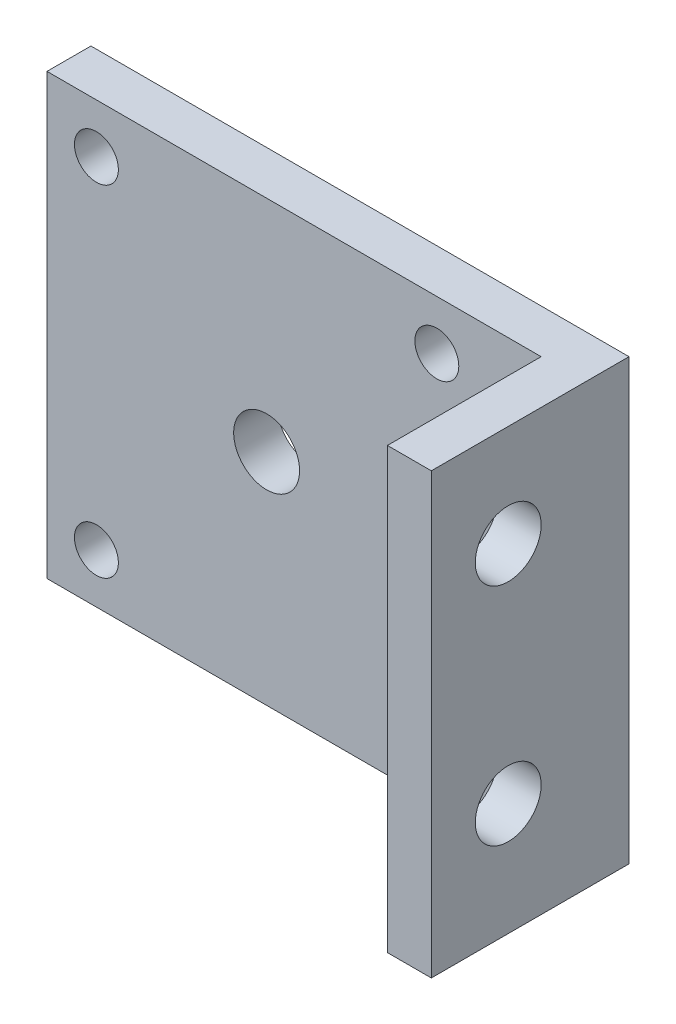
ISO-10303-21;
HEADER;
FILE_DESCRIPTION(('STEP AP214'),'2;1');
FILE_NAME('part.step','',(''),(''),'','','');
FILE_SCHEMA(('AUTOMOTIVE_DESIGN { 1 0 10303 214 1 1 1 1 }'));
ENDSEC;
DATA;
#1=APPLICATION_CONTEXT('core data for automotive mechanical design processes');
#2=APPLICATION_PROTOCOL_DEFINITION('international standard','automotive_design',2000,#1);
#3=PRODUCT_CONTEXT('',#1,'mechanical');
#4=PRODUCT('Part','Part','',(#3));
#5=PRODUCT_RELATED_PRODUCT_CATEGORY('part','',(#4));
#6=PRODUCT_DEFINITION_FORMATION('','',#4);
#7=PRODUCT_DEFINITION_CONTEXT('part definition',#1,'design');
#8=PRODUCT_DEFINITION('design','',#6,#7);
#9=PRODUCT_DEFINITION_SHAPE('','',#8);
#10=(LENGTH_UNIT() NAMED_UNIT(*) SI_UNIT(.MILLI.,.METRE.));
#11=(NAMED_UNIT(*) PLANE_ANGLE_UNIT() SI_UNIT($,.RADIAN.));
#12=(NAMED_UNIT(*) SI_UNIT($,.STERADIAN.) SOLID_ANGLE_UNIT());
#13=UNCERTAINTY_MEASURE_WITH_UNIT(LENGTH_MEASURE(1.E-05),#10,'distance_accuracy_value','');
#14=(GEOMETRIC_REPRESENTATION_CONTEXT(3) GLOBAL_UNCERTAINTY_ASSIGNED_CONTEXT((#13)) GLOBAL_UNIT_ASSIGNED_CONTEXT((#10,
#11,#12)) REPRESENTATION_CONTEXT('',''));
#15=CARTESIAN_POINT('',(0.,0.,0.));
#16=DIRECTION('',(0.,0.,1.));
#17=DIRECTION('',(1.,0.,0.));
#18=AXIS2_PLACEMENT_3D('',#15,#16,#17);
#19=CARTESIAN_POINT('',(-27.0858644859813,17.290404040404,4.));
#20=DIRECTION('',(1.,0.,0.));
#21=DIRECTION('',(0.,1.,0.));
#22=AXIS2_PLACEMENT_3D('',#19,#20,#21);
#23=PLANE('',#22);
#24=DIRECTION('',(0.,-1.,0.));
#25=VECTOR('',#24,1.);
#26=CARTESIAN_POINT('',(-27.0858644859813,17.290404040404,0.));
#27=LINE('',#26,#25);
#28=CARTESIAN_POINT('',(-27.0858644859813,17.290404040404,0.));
#29=VERTEX_POINT('',#28);
#30=CARTESIAN_POINT('',(-27.0858644859813,-22.709595959596,0.));
#31=VERTEX_POINT('',#30);
#32=EDGE_CURVE('E91',#29,#31,#27,.T.);
#33=ORIENTED_EDGE('',*,*,#32,.T.);
#34=DIRECTION('',(0.,0.,-1.));
#35=VECTOR('',#34,1.);
#36=CARTESIAN_POINT('',(-27.0858644859813,-22.709595959596,4.));
#37=LINE('',#36,#35);
#38=CARTESIAN_POINT('',(-27.0858644859813,-22.709595959596,4.));
#39=VERTEX_POINT('',#38);
#40=EDGE_CURVE('E11',#39,#31,#37,.T.);
#41=ORIENTED_EDGE('',*,*,#40,.F.);
#42=DIRECTION('',(0.,-1.,0.));
#43=VECTOR('',#42,1.);
#44=CARTESIAN_POINT('',(-27.0858644859813,17.290404040404,4.));
#45=LINE('',#44,#43);
#46=CARTESIAN_POINT('',(-27.0858644859813,17.290404040404,4.));
#47=VERTEX_POINT('',#46);
#48=EDGE_CURVE('E85',#47,#39,#45,.T.);
#49=ORIENTED_EDGE('',*,*,#48,.F.);
#50=DIRECTION('',(0.,0.,-1.));
#51=VECTOR('',#50,1.);
#52=CARTESIAN_POINT('',(-27.0858644859813,17.290404040404,4.));
#53=LINE('',#52,#51);
#54=EDGE_CURVE('E77',#47,#29,#53,.T.);
#55=ORIENTED_EDGE('',*,*,#54,.T.);
#56=EDGE_LOOP('',(#33,#41,#49,#55));
#57=FACE_BOUND('',#56,.T.);
#58=ADVANCED_FACE('F33',(#57),#23,.F.);
#59=CARTESIAN_POINT('',(-27.0858644859813,-22.709595959596,4.));
#60=DIRECTION('',(0.,1.,0.));
#61=DIRECTION('',(0.,0.,1.));
#62=AXIS2_PLACEMENT_3D('',#59,#60,#61);
#63=PLANE('',#62);
#64=DIRECTION('',(1.,0.,0.));
#65=VECTOR('',#64,1.);
#66=CARTESIAN_POINT('',(-27.0858644859813,-22.709595959596,0.));
#67=LINE('',#66,#65);
#68=CARTESIAN_POINT('',(21.9141355140187,-22.709595959596,0.));
#69=VERTEX_POINT('',#68);
#70=EDGE_CURVE('E94',#31,#69,#67,.T.);
#71=ORIENTED_EDGE('',*,*,#70,.T.);
#72=DIRECTION('',(0.,0.,-1.));
#73=VECTOR('',#72,1.);
#74=CARTESIAN_POINT('',(21.9141355140187,-22.709595959596,4.));
#75=LINE('',#74,#73);
#76=CARTESIAN_POINT('',(21.9141355140187,-22.709595959596,18.));
#77=VERTEX_POINT('',#76);
#78=EDGE_CURVE('E41',#77,#69,#75,.T.);
#79=ORIENTED_EDGE('',*,*,#78,.F.);
#80=DIRECTION('',(1.,0.,0.));
#81=VECTOR('',#80,1.);
#82=CARTESIAN_POINT('',(21.9141355140187,-22.709595959596,18.));
#83=LINE('',#82,#81);
#84=CARTESIAN_POINT('',(17.9141355140187,-22.709595959596,18.));
#85=VERTEX_POINT('',#84);
#86=EDGE_CURVE('E116',#85,#77,#83,.T.);
#87=ORIENTED_EDGE('',*,*,#86,.F.);
#88=DIRECTION('',(0.,0.,-1.));
#89=VECTOR('',#88,1.);
#90=CARTESIAN_POINT('',(17.9141355140187,-22.709595959596,18.));
#91=LINE('',#90,#89);
#92=CARTESIAN_POINT('',(17.9141355140187,-22.709595959596,4.));
#93=VERTEX_POINT('',#92);
#94=EDGE_CURVE('E99',#85,#93,#91,.T.);
#95=ORIENTED_EDGE('',*,*,#94,.T.);
#96=DIRECTION('',(1.,0.,0.));
#97=VECTOR('',#96,1.);
#98=CARTESIAN_POINT('',(-27.0858644859813,-22.709595959596,4.));
#99=LINE('',#98,#97);
#100=EDGE_CURVE('E108',#39,#93,#99,.T.);
#101=ORIENTED_EDGE('',*,*,#100,.F.);
#102=ORIENTED_EDGE('',*,*,#40,.T.);
#103=EDGE_LOOP('',(#71,#79,#87,#95,#101,#102));
#104=FACE_BOUND('',#103,.T.);
#105=ADVANCED_FACE('F222',(#104),#63,.F.);
#106=CARTESIAN_POINT('',(21.9141355140187,17.290404040404,4.));
#107=DIRECTION('',(-1.,0.,0.));
#108=DIRECTION('',(0.,-1.,0.));
#109=AXIS2_PLACEMENT_3D('',#106,#107,#108);
#110=PLANE('',#109);
#111=CARTESIAN_POINT('',(21.9141355140187,-12.4595959595959,11.));
#112=DIRECTION('',(1.,0.,0.));
#113=DIRECTION('',(0.,1.,0.));
#114=AXIS2_PLACEMENT_3D('',#111,#112,#113);
#115=CIRCLE('',#114,3.);
#116=CARTESIAN_POINT('',(21.9141355140187,-9.45959595959595,11.));
#117=VERTEX_POINT('',#116);
#118=EDGE_CURVE('E147',#117,#117,#115,.T.);
#119=ORIENTED_EDGE('',*,*,#118,.F.);
#120=EDGE_LOOP('',(#119));
#121=FACE_BOUND('',#120,.T.);
#122=CARTESIAN_POINT('',(21.9141355140187,8.04040404040405,11.));
#123=DIRECTION('',(1.,0.,0.));
#124=DIRECTION('',(0.,1.,0.));
#125=AXIS2_PLACEMENT_3D('',#122,#123,#124);
#126=CIRCLE('',#125,3.);
#127=CARTESIAN_POINT('',(21.9141355140187,11.0404040404041,11.));
#128=VERTEX_POINT('',#127);
#129=EDGE_CURVE('E141',#128,#128,#126,.T.);
#130=ORIENTED_EDGE('',*,*,#129,.F.);
#131=EDGE_LOOP('',(#130));
#132=FACE_BOUND('',#131,.T.);
#133=DIRECTION('',(0.,1.,0.));
#134=VECTOR('',#133,1.);
#135=CARTESIAN_POINT('',(21.9141355140187,17.290404040404,0.));
#136=LINE('',#135,#134);
#137=CARTESIAN_POINT('',(21.9141355140187,17.290404040404,0.));
#138=VERTEX_POINT('',#137);
#139=EDGE_CURVE('E86',#69,#138,#136,.T.);
#140=ORIENTED_EDGE('',*,*,#139,.T.);
#141=DIRECTION('',(0.,0.,-1.));
#142=VECTOR('',#141,1.);
#143=CARTESIAN_POINT('',(21.9141355140187,17.290404040404,4.));
#144=LINE('',#143,#142);
#145=CARTESIAN_POINT('',(21.9141355140187,17.290404040404,18.));
#146=VERTEX_POINT('',#145);
#147=EDGE_CURVE('E81',#146,#138,#144,.T.);
#148=ORIENTED_EDGE('',*,*,#147,.F.);
#149=DIRECTION('',(0.,1.,0.));
#150=VECTOR('',#149,1.);
#151=CARTESIAN_POINT('',(21.9141355140187,17.290404040404,18.));
#152=LINE('',#151,#150);
#153=EDGE_CURVE('E119',#77,#146,#152,.T.);
#154=ORIENTED_EDGE('',*,*,#153,.F.);
#155=ORIENTED_EDGE('',*,*,#78,.T.);
#156=EDGE_LOOP('',(#140,#148,#154,#155));
#157=FACE_BOUND('',#156,.T.);
#158=ADVANCED_FACE('F226',(#121,#132,#157),#110,.F.);
#159=CARTESIAN_POINT('',(-27.0858644859813,17.290404040404,4.));
#160=DIRECTION('',(0.,-1.,0.));
#161=DIRECTION('',(0.,0.,-1.));
#162=AXIS2_PLACEMENT_3D('',#159,#160,#161);
#163=PLANE('',#162);
#164=DIRECTION('',(-1.,0.,0.));
#165=VECTOR('',#164,1.);
#166=CARTESIAN_POINT('',(-27.0858644859813,17.290404040404,0.));
#167=LINE('',#166,#165);
#168=EDGE_CURVE('E74',#138,#29,#167,.T.);
#169=ORIENTED_EDGE('',*,*,#168,.T.);
#170=ORIENTED_EDGE('',*,*,#54,.F.);
#171=DIRECTION('',(-1.,0.,0.));
#172=VECTOR('',#171,1.);
#173=CARTESIAN_POINT('',(-27.0858644859813,17.290404040404,4.));
#174=LINE('',#173,#172);
#175=CARTESIAN_POINT('',(17.9141355140187,17.290404040404,4.));
#176=VERTEX_POINT('',#175);
#177=EDGE_CURVE('E54',#176,#47,#174,.T.);
#178=ORIENTED_EDGE('',*,*,#177,.F.);
#179=DIRECTION('',(0.,0.,-1.));
#180=VECTOR('',#179,1.);
#181=CARTESIAN_POINT('',(17.9141355140187,17.290404040404,18.));
#182=LINE('',#181,#180);
#183=CARTESIAN_POINT('',(17.9141355140187,17.290404040404,18.));
#184=VERTEX_POINT('',#183);
#185=EDGE_CURVE('E95',#184,#176,#182,.T.);
#186=ORIENTED_EDGE('',*,*,#185,.F.);
#187=DIRECTION('',(-1.,0.,0.));
#188=VECTOR('',#187,1.);
#189=CARTESIAN_POINT('',(21.9141355140187,17.290404040404,18.));
#190=LINE('',#189,#188);
#191=EDGE_CURVE('E134',#146,#184,#190,.T.);
#192=ORIENTED_EDGE('',*,*,#191,.F.);
#193=ORIENTED_EDGE('',*,*,#147,.T.);
#194=EDGE_LOOP('',(#169,#170,#178,#186,#192,#193));
#195=FACE_BOUND('',#194,.T.);
#196=ADVANCED_FACE('F76',(#195),#163,.F.);
#197=CARTESIAN_POINT('',(0.,0.,4.));
#198=DIRECTION('',(0.,0.,1.));
#199=DIRECTION('',(1.,0.,0.));
#200=AXIS2_PLACEMENT_3D('',#197,#198,#199);
#201=PLANE('',#200);
#202=CARTESIAN_POINT('',(-22.5858644859813,-18.209595959596,4.));
#203=DIRECTION('',(0.,0.,1.));
#204=DIRECTION('',(1.,0.,0.));
#205=AXIS2_PLACEMENT_3D('',#202,#203,#204);
#206=CIRCLE('',#205,2.);
#207=CARTESIAN_POINT('',(-20.5858644859813,-18.209595959596,4.));
#208=VERTEX_POINT('',#207);
#209=EDGE_CURVE('E177',#208,#208,#206,.T.);
#210=ORIENTED_EDGE('',*,*,#209,.F.);
#211=EDGE_LOOP('',(#210));
#212=FACE_BOUND('',#211,.T.);
#213=CARTESIAN_POINT('',(8.4141355140187,-18.2095959595959,4.));
#214=DIRECTION('',(0.,0.,1.));
#215=DIRECTION('',(1.,0.,0.));
#216=AXIS2_PLACEMENT_3D('',#213,#214,#215);
#217=CIRCLE('',#216,2.);
#218=CARTESIAN_POINT('',(10.4141355140187,-18.2095959595959,4.));
#219=VERTEX_POINT('',#218);
#220=EDGE_CURVE('E171',#219,#219,#217,.T.);
#221=ORIENTED_EDGE('',*,*,#220,.F.);
#222=EDGE_LOOP('',(#221));
#223=FACE_BOUND('',#222,.T.);
#224=CARTESIAN_POINT('',(8.4141355140187,12.7904040404041,4.));
#225=DIRECTION('',(0.,0.,1.));
#226=DIRECTION('',(1.,0.,0.));
#227=AXIS2_PLACEMENT_3D('',#224,#225,#226);
#228=CIRCLE('',#227,2.);
#229=CARTESIAN_POINT('',(10.4141355140187,12.7904040404041,4.));
#230=VERTEX_POINT('',#229);
#231=EDGE_CURVE('E165',#230,#230,#228,.T.);
#232=ORIENTED_EDGE('',*,*,#231,.F.);
#233=EDGE_LOOP('',(#232));
#234=FACE_BOUND('',#233,.T.);
#235=CARTESIAN_POINT('',(-22.5858644859813,12.7904040404041,4.));
#236=DIRECTION('',(0.,0.,1.));
#237=DIRECTION('',(1.,0.,0.));
#238=AXIS2_PLACEMENT_3D('',#235,#236,#237);
#239=CIRCLE('',#238,2.);
#240=CARTESIAN_POINT('',(-20.5858644859813,12.7904040404041,4.));
#241=VERTEX_POINT('',#240);
#242=EDGE_CURVE('E159',#241,#241,#239,.T.);
#243=ORIENTED_EDGE('',*,*,#242,.F.);
#244=EDGE_LOOP('',(#243));
#245=FACE_BOUND('',#244,.T.);
#246=CARTESIAN_POINT('',(-7.0858644859813,-2.70959595959595,4.));
#247=DIRECTION('',(0.,0.,1.));
#248=DIRECTION('',(1.,0.,0.));
#249=AXIS2_PLACEMENT_3D('',#246,#247,#248);
#250=CIRCLE('',#249,3.);
#251=CARTESIAN_POINT('',(-4.0858644859813,-2.70959595959595,4.));
#252=VERTEX_POINT('',#251);
#253=EDGE_CURVE('E153',#252,#252,#250,.T.);
#254=ORIENTED_EDGE('',*,*,#253,.F.);
#255=EDGE_LOOP('',(#254));
#256=FACE_BOUND('',#255,.T.);
#257=DIRECTION('',(0.,-1.,0.));
#258=VECTOR('',#257,1.);
#259=CARTESIAN_POINT('',(17.9141355140187,17.290404040404,4.));
#260=LINE('',#259,#258);
#261=EDGE_CURVE('E49',#176,#93,#260,.T.);
#262=ORIENTED_EDGE('',*,*,#261,.F.);
#263=ORIENTED_EDGE('',*,*,#177,.T.);
#264=ORIENTED_EDGE('',*,*,#48,.T.);
#265=ORIENTED_EDGE('',*,*,#100,.T.);
#266=EDGE_LOOP('',(#262,#263,#264,#265));
#267=FACE_BOUND('',#266,.T.);
#268=ADVANCED_FACE('F192',(#212,#223,#234,#245,#256,#267),#201,.T.);
#269=CARTESIAN_POINT('',(0.,0.,0.));
#270=DIRECTION('',(0.,0.,1.));
#271=DIRECTION('',(1.,0.,0.));
#272=AXIS2_PLACEMENT_3D('',#269,#270,#271);
#273=PLANE('',#272);
#274=CARTESIAN_POINT('',(-22.5858644859813,-18.209595959596,0.));
#275=DIRECTION('',(0.,0.,1.));
#276=DIRECTION('',(1.,0.,0.));
#277=AXIS2_PLACEMENT_3D('',#274,#275,#276);
#278=CIRCLE('',#277,2.);
#279=CARTESIAN_POINT('',(-20.5858644859813,-18.209595959596,0.));
#280=VERTEX_POINT('',#279);
#281=EDGE_CURVE('E174',#280,#280,#278,.T.);
#282=ORIENTED_EDGE('',*,*,#281,.T.);
#283=EDGE_LOOP('',(#282));
#284=FACE_BOUND('',#283,.T.);
#285=CARTESIAN_POINT('',(8.4141355140187,-18.2095959595959,0.));
#286=DIRECTION('',(0.,0.,1.));
#287=DIRECTION('',(1.,0.,0.));
#288=AXIS2_PLACEMENT_3D('',#285,#286,#287);
#289=CIRCLE('',#288,2.);
#290=CARTESIAN_POINT('',(10.4141355140187,-18.2095959595959,0.));
#291=VERTEX_POINT('',#290);
#292=EDGE_CURVE('E168',#291,#291,#289,.T.);
#293=ORIENTED_EDGE('',*,*,#292,.T.);
#294=EDGE_LOOP('',(#293));
#295=FACE_BOUND('',#294,.T.);
#296=CARTESIAN_POINT('',(8.4141355140187,12.7904040404041,0.));
#297=DIRECTION('',(0.,0.,1.));
#298=DIRECTION('',(1.,0.,0.));
#299=AXIS2_PLACEMENT_3D('',#296,#297,#298);
#300=CIRCLE('',#299,2.);
#301=CARTESIAN_POINT('',(10.4141355140187,12.7904040404041,0.));
#302=VERTEX_POINT('',#301);
#303=EDGE_CURVE('E162',#302,#302,#300,.T.);
#304=ORIENTED_EDGE('',*,*,#303,.T.);
#305=EDGE_LOOP('',(#304));
#306=FACE_BOUND('',#305,.T.);
#307=CARTESIAN_POINT('',(-22.5858644859813,12.7904040404041,0.));
#308=DIRECTION('',(0.,0.,1.));
#309=DIRECTION('',(1.,0.,0.));
#310=AXIS2_PLACEMENT_3D('',#307,#308,#309);
#311=CIRCLE('',#310,2.);
#312=CARTESIAN_POINT('',(-20.5858644859813,12.7904040404041,0.));
#313=VERTEX_POINT('',#312);
#314=EDGE_CURVE('E156',#313,#313,#311,.T.);
#315=ORIENTED_EDGE('',*,*,#314,.T.);
#316=EDGE_LOOP('',(#315));
#317=FACE_BOUND('',#316,.T.);
#318=CARTESIAN_POINT('',(-7.0858644859813,-2.70959595959595,0.));
#319=DIRECTION('',(0.,0.,1.));
#320=DIRECTION('',(1.,0.,0.));
#321=AXIS2_PLACEMENT_3D('',#318,#319,#320);
#322=CIRCLE('',#321,3.);
#323=CARTESIAN_POINT('',(-4.0858644859813,-2.70959595959595,0.));
#324=VERTEX_POINT('',#323);
#325=EDGE_CURVE('E150',#324,#324,#322,.T.);
#326=ORIENTED_EDGE('',*,*,#325,.T.);
#327=EDGE_LOOP('',(#326));
#328=FACE_BOUND('',#327,.T.);
#329=ORIENTED_EDGE('',*,*,#32,.F.);
#330=ORIENTED_EDGE('',*,*,#168,.F.);
#331=ORIENTED_EDGE('',*,*,#139,.F.);
#332=ORIENTED_EDGE('',*,*,#70,.F.);
#333=EDGE_LOOP('',(#329,#330,#331,#332));
#334=FACE_BOUND('',#333,.T.);
#335=ADVANCED_FACE('F93',(#284,#295,#306,#317,#328,#334),#273,.F.);
#336=CARTESIAN_POINT('',(17.9141355140187,17.290404040404,18.));
#337=DIRECTION('',(1.,0.,0.));
#338=DIRECTION('',(0.,1.,0.));
#339=AXIS2_PLACEMENT_3D('',#336,#337,#338);
#340=PLANE('',#339);
#341=CARTESIAN_POINT('',(17.9141355140187,-12.4595959595959,11.));
#342=DIRECTION('',(1.,0.,0.));
#343=DIRECTION('',(0.,1.,0.));
#344=AXIS2_PLACEMENT_3D('',#341,#342,#343);
#345=CIRCLE('',#344,3.);
#346=CARTESIAN_POINT('',(17.9141355140187,-9.45959595959595,11.));
#347=VERTEX_POINT('',#346);
#348=EDGE_CURVE('E144',#347,#347,#345,.T.);
#349=ORIENTED_EDGE('',*,*,#348,.T.);
#350=EDGE_LOOP('',(#349));
#351=FACE_BOUND('',#350,.T.);
#352=CARTESIAN_POINT('',(17.9141355140187,8.04040404040405,11.));
#353=DIRECTION('',(1.,0.,0.));
#354=DIRECTION('',(0.,1.,0.));
#355=AXIS2_PLACEMENT_3D('',#352,#353,#354);
#356=CIRCLE('',#355,3.);
#357=CARTESIAN_POINT('',(17.9141355140187,11.0404040404041,11.));
#358=VERTEX_POINT('',#357);
#359=EDGE_CURVE('E120',#358,#358,#356,.T.);
#360=ORIENTED_EDGE('',*,*,#359,.T.);
#361=EDGE_LOOP('',(#360));
#362=FACE_BOUND('',#361,.T.);
#363=ORIENTED_EDGE('',*,*,#261,.T.);
#364=ORIENTED_EDGE('',*,*,#94,.F.);
#365=DIRECTION('',(0.,-1.,0.));
#366=VECTOR('',#365,1.);
#367=CARTESIAN_POINT('',(17.9141355140187,17.290404040404,18.));
#368=LINE('',#367,#366);
#369=EDGE_CURVE('E129',#184,#85,#368,.T.);
#370=ORIENTED_EDGE('',*,*,#369,.F.);
#371=ORIENTED_EDGE('',*,*,#185,.T.);
#372=EDGE_LOOP('',(#363,#364,#370,#371));
#373=FACE_BOUND('',#372,.T.);
#374=ADVANCED_FACE('F236',(#351,#362,#373),#340,.F.);
#375=CARTESIAN_POINT('',(0.,0.,18.));
#376=DIRECTION('',(0.,0.,-1.));
#377=DIRECTION('',(-1.,0.,0.));
#378=AXIS2_PLACEMENT_3D('',#375,#376,#377);
#379=PLANE('',#378);
#380=ORIENTED_EDGE('',*,*,#153,.T.);
#381=ORIENTED_EDGE('',*,*,#191,.T.);
#382=ORIENTED_EDGE('',*,*,#369,.T.);
#383=ORIENTED_EDGE('',*,*,#86,.T.);
#384=EDGE_LOOP('',(#380,#381,#382,#383));
#385=FACE_BOUND('',#384,.T.);
#386=ADVANCED_FACE('F240',(#385),#379,.F.);
#387=CARTESIAN_POINT('',(17.9141355140187,8.04040404040405,11.));
#388=DIRECTION('',(1.,0.,0.));
#389=DIRECTION('',(0.,1.,0.));
#390=AXIS2_PLACEMENT_3D('',#387,#388,#389);
#391=CYLINDRICAL_SURFACE('',#390,3.);
#392=ORIENTED_EDGE('',*,*,#359,.F.);
#393=EDGE_LOOP('',(#392));
#394=FACE_BOUND('',#393,.T.);
#395=ORIENTED_EDGE('',*,*,#129,.T.);
#396=EDGE_LOOP('',(#395));
#397=FACE_BOUND('',#396,.T.);
#398=ADVANCED_FACE('F217',(#394,#397),#391,.F.);
#399=CARTESIAN_POINT('',(17.9141355140187,-12.4595959595959,11.));
#400=DIRECTION('',(1.,0.,0.));
#401=DIRECTION('',(0.,1.,0.));
#402=AXIS2_PLACEMENT_3D('',#399,#400,#401);
#403=CYLINDRICAL_SURFACE('',#402,3.);
#404=ORIENTED_EDGE('',*,*,#348,.F.);
#405=EDGE_LOOP('',(#404));
#406=FACE_BOUND('',#405,.T.);
#407=ORIENTED_EDGE('',*,*,#118,.T.);
#408=EDGE_LOOP('',(#407));
#409=FACE_BOUND('',#408,.T.);
#410=ADVANCED_FACE('F207',(#406,#409),#403,.F.);
#411=CARTESIAN_POINT('',(-7.0858644859813,-2.70959595959595,0.));
#412=DIRECTION('',(0.,0.,1.));
#413=DIRECTION('',(1.,0.,0.));
#414=AXIS2_PLACEMENT_3D('',#411,#412,#413);
#415=CYLINDRICAL_SURFACE('',#414,3.);
#416=ORIENTED_EDGE('',*,*,#325,.F.);
#417=EDGE_LOOP('',(#416));
#418=FACE_BOUND('',#417,.T.);
#419=ORIENTED_EDGE('',*,*,#253,.T.);
#420=EDGE_LOOP('',(#419));
#421=FACE_BOUND('',#420,.T.);
#422=ADVANCED_FACE('F204',(#418,#421),#415,.F.);
#423=CARTESIAN_POINT('',(-22.5858644859813,12.7904040404041,0.));
#424=DIRECTION('',(0.,0.,1.));
#425=DIRECTION('',(1.,0.,0.));
#426=AXIS2_PLACEMENT_3D('',#423,#424,#425);
#427=CYLINDRICAL_SURFACE('',#426,2.);
#428=ORIENTED_EDGE('',*,*,#314,.F.);
#429=EDGE_LOOP('',(#428));
#430=FACE_BOUND('',#429,.T.);
#431=ORIENTED_EDGE('',*,*,#242,.T.);
#432=EDGE_LOOP('',(#431));
#433=FACE_BOUND('',#432,.T.);
#434=ADVANCED_FACE('F206',(#430,#433),#427,.F.);
#435=CARTESIAN_POINT('',(8.4141355140187,12.7904040404041,0.));
#436=DIRECTION('',(0.,0.,1.));
#437=DIRECTION('',(1.,0.,0.));
#438=AXIS2_PLACEMENT_3D('',#435,#436,#437);
#439=CYLINDRICAL_SURFACE('',#438,2.);
#440=ORIENTED_EDGE('',*,*,#303,.F.);
#441=EDGE_LOOP('',(#440));
#442=FACE_BOUND('',#441,.T.);
#443=ORIENTED_EDGE('',*,*,#231,.T.);
#444=EDGE_LOOP('',(#443));
#445=FACE_BOUND('',#444,.T.);
#446=ADVANCED_FACE('F214',(#442,#445),#439,.F.);
#447=CARTESIAN_POINT('',(8.4141355140187,-18.2095959595959,0.));
#448=DIRECTION('',(0.,0.,1.));
#449=DIRECTION('',(1.,0.,0.));
#450=AXIS2_PLACEMENT_3D('',#447,#448,#449);
#451=CYLINDRICAL_SURFACE('',#450,2.);
#452=ORIENTED_EDGE('',*,*,#292,.F.);
#453=EDGE_LOOP('',(#452));
#454=FACE_BOUND('',#453,.T.);
#455=ORIENTED_EDGE('',*,*,#220,.T.);
#456=EDGE_LOOP('',(#455));
#457=FACE_BOUND('',#456,.T.);
#458=ADVANCED_FACE('F188',(#454,#457),#451,.F.);
#459=CARTESIAN_POINT('',(-22.5858644859813,-18.209595959596,0.));
#460=DIRECTION('',(0.,0.,1.));
#461=DIRECTION('',(1.,0.,0.));
#462=AXIS2_PLACEMENT_3D('',#459,#460,#461);
#463=CYLINDRICAL_SURFACE('',#462,2.);
#464=ORIENTED_EDGE('',*,*,#281,.F.);
#465=EDGE_LOOP('',(#464));
#466=FACE_BOUND('',#465,.T.);
#467=ORIENTED_EDGE('',*,*,#209,.T.);
#468=EDGE_LOOP('',(#467));
#469=FACE_BOUND('',#468,.T.);
#470=ADVANCED_FACE('F185',(#466,#469),#463,.F.);
#471=CLOSED_SHELL('',(#58,#105,#158,#196,#268,#335,#374,#386,#398,#410,#422,#434,#446,#458,#470));
#472=MANIFOLD_SOLID_BREP('B2',#471);
#473=ADVANCED_BREP_SHAPE_REPRESENTATION('',(#18,#472),#14);
#474=SHAPE_DEFINITION_REPRESENTATION(#9,#473);
ENDSEC;
END-ISO-10303-21;
